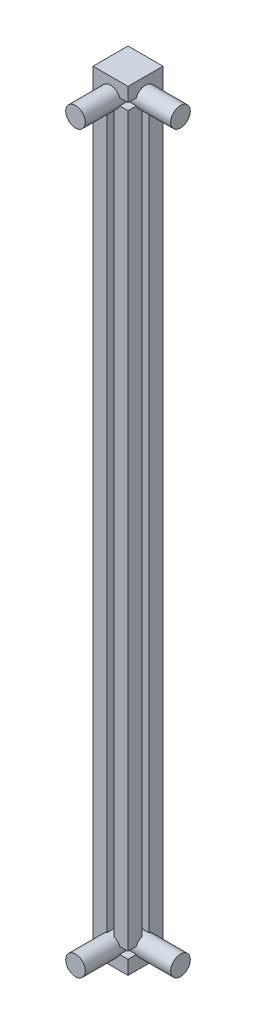
ISO-10303-21;
HEADER;
FILE_DESCRIPTION(('STEP AP214'),'2;1');
FILE_NAME('part.step','',(''),(''),'','','');
FILE_SCHEMA(('AUTOMOTIVE_DESIGN { 1 0 10303 214 1 1 1 1 }'));
ENDSEC;
DATA;
#1=APPLICATION_CONTEXT('core data for automotive mechanical design processes');
#2=APPLICATION_PROTOCOL_DEFINITION('international standard','automotive_design',2000,#1);
#3=PRODUCT_CONTEXT('',#1,'mechanical');
#4=PRODUCT('Part','Part','',(#3));
#5=PRODUCT_RELATED_PRODUCT_CATEGORY('part','',(#4));
#6=PRODUCT_DEFINITION_FORMATION('','',#4);
#7=PRODUCT_DEFINITION_CONTEXT('part definition',#1,'design');
#8=PRODUCT_DEFINITION('design','',#6,#7);
#9=PRODUCT_DEFINITION_SHAPE('','',#8);
#10=(LENGTH_UNIT() NAMED_UNIT(*) SI_UNIT(.MILLI.,.METRE.));
#11=(NAMED_UNIT(*) PLANE_ANGLE_UNIT() SI_UNIT($,.RADIAN.));
#12=(NAMED_UNIT(*) SI_UNIT($,.STERADIAN.) SOLID_ANGLE_UNIT());
#13=UNCERTAINTY_MEASURE_WITH_UNIT(LENGTH_MEASURE(1.E-05),#10,'distance_accuracy_value','');
#14=(GEOMETRIC_REPRESENTATION_CONTEXT(3) GLOBAL_UNCERTAINTY_ASSIGNED_CONTEXT((#13)) GLOBAL_UNIT_ASSIGNED_CONTEXT((#10,
#11,#12)) REPRESENTATION_CONTEXT('',''));
#15=CARTESIAN_POINT('',(0.,0.,0.));
#16=DIRECTION('',(0.,0.,1.));
#17=DIRECTION('',(1.,0.,0.));
#18=AXIS2_PLACEMENT_3D('',#15,#16,#17);
#19=CARTESIAN_POINT('',(10.,-10.,10.));
#20=DIRECTION('',(1.,0.,0.));
#21=DIRECTION('',(0.,0.,-1.));
#22=AXIS2_PLACEMENT_3D('',#19,#20,#21);
#23=PLANE('',#22);
#24=CARTESIAN_POINT('',(10.,-215.,5.));
#25=DIRECTION('',(1.,0.,0.));
#26=DIRECTION('',(0.,0.,-1.));
#27=AXIS2_PLACEMENT_3D('',#24,#25,#26);
#28=CIRCLE('',#27,2.8);
#29=CARTESIAN_POINT('',(10.,-212.384660633876,5.99999999999998));
#30=VERTEX_POINT('',#29);
#31=CARTESIAN_POINT('',(10.,-214.,7.6153393661244));
#32=VERTEX_POINT('',#31);
#33=EDGE_CURVE('E418',#30,#32,#28,.T.);
#34=ORIENTED_EDGE('',*,*,#33,.F.);
#35=DIRECTION('',(0.,-1.,0.));
#36=VECTOR('',#35,1.);
#37=CARTESIAN_POINT('',(10.,-10.,5.99999999999998));
#38=LINE('',#37,#36);
#39=CARTESIAN_POINT('',(10.,-7.61533936612441,5.99999999999998));
#40=VERTEX_POINT('',#39);
#41=EDGE_CURVE('E269',#40,#30,#38,.T.);
#42=ORIENTED_EDGE('',*,*,#41,.F.);
#43=CARTESIAN_POINT('',(10.,-5.,5.));
#44=DIRECTION('',(1.,0.,0.));
#45=DIRECTION('',(0.,0.,-1.));
#46=AXIS2_PLACEMENT_3D('',#43,#44,#45);
#47=CIRCLE('',#46,2.8);
#48=CARTESIAN_POINT('',(10.,-6.,7.61533936612441));
#49=VERTEX_POINT('',#48);
#50=EDGE_CURVE('E64',#49,#40,#47,.T.);
#51=ORIENTED_EDGE('',*,*,#50,.F.);
#52=DIRECTION('',(0.,0.,1.));
#53=VECTOR('',#52,1.);
#54=CARTESIAN_POINT('',(10.,-6.,6.5));
#55=LINE('',#54,#53);
#56=CARTESIAN_POINT('',(10.,-6.00000000000001,10.));
#57=VERTEX_POINT('',#56);
#58=EDGE_CURVE('E247',#49,#57,#55,.T.);
#59=ORIENTED_EDGE('',*,*,#58,.T.);
#60=DIRECTION('',(0.,-1.,0.));
#61=VECTOR('',#60,1.);
#62=CARTESIAN_POINT('',(10.,-10.,10.));
#63=LINE('',#62,#61);
#64=CARTESIAN_POINT('',(10.,-214.,10.));
#65=VERTEX_POINT('',#64);
#66=EDGE_CURVE('E308',#57,#65,#63,.T.);
#67=ORIENTED_EDGE('',*,*,#66,.T.);
#68=DIRECTION('',(0.,0.,1.));
#69=VECTOR('',#68,1.);
#70=CARTESIAN_POINT('',(10.,-214.,6.5));
#71=LINE('',#70,#69);
#72=EDGE_CURVE('E252',#32,#65,#71,.T.);
#73=ORIENTED_EDGE('',*,*,#72,.F.);
#74=EDGE_LOOP('',(#34,#42,#51,#59,#67,#73));
#75=FACE_BOUND('',#74,.T.);
#76=ADVANCED_FACE('F41',(#75),#23,.T.);
#77=CARTESIAN_POINT('',(0.,0.,10.));
#78=DIRECTION('',(0.,0.,1.));
#79=DIRECTION('',(1.,0.,0.));
#80=AXIS2_PLACEMENT_3D('',#77,#78,#79);
#81=PLANE('',#80);
#82=DIRECTION('',(-1.,0.,0.));
#83=VECTOR('',#82,1.);
#84=CARTESIAN_POINT('',(0.,-216.,10.));
#85=LINE('',#84,#83);
#86=CARTESIAN_POINT('',(10.,-216.,10.));
#87=VERTEX_POINT('',#86);
#88=CARTESIAN_POINT('',(7.6153393661244,-216.,10.));
#89=VERTEX_POINT('',#88);
#90=EDGE_CURVE('E294',#87,#89,#85,.T.);
#91=ORIENTED_EDGE('',*,*,#90,.T.);
#92=CARTESIAN_POINT('',(5.,-215.,10.));
#93=DIRECTION('',(0.,0.,1.));
#94=DIRECTION('',(1.,0.,0.));
#95=AXIS2_PLACEMENT_3D('',#92,#93,#94);
#96=CIRCLE('',#95,2.8);
#97=CARTESIAN_POINT('',(4.00000000000002,-212.384660633876,10.));
#98=VERTEX_POINT('',#97);
#99=EDGE_CURVE('E198',#89,#98,#96,.F.);
#100=ORIENTED_EDGE('',*,*,#99,.T.);
#101=DIRECTION('',(0.,-1.,0.));
#102=VECTOR('',#101,1.);
#103=CARTESIAN_POINT('',(4.00000000000003,0.,10.));
#104=LINE('',#103,#102);
#105=CARTESIAN_POINT('',(4.00000000000003,-7.61533936612442,10.));
#106=VERTEX_POINT('',#105);
#107=EDGE_CURVE('E291',#106,#98,#104,.T.);
#108=ORIENTED_EDGE('',*,*,#107,.F.);
#109=CARTESIAN_POINT('',(5.,-5.,10.));
#110=DIRECTION('',(0.,0.,1.));
#111=DIRECTION('',(1.,0.,0.));
#112=AXIS2_PLACEMENT_3D('',#109,#110,#111);
#113=CIRCLE('',#112,2.8);
#114=CARTESIAN_POINT('',(7.61533936612441,-4.,10.));
#115=VERTEX_POINT('',#114);
#116=EDGE_CURVE('E228',#115,#106,#113,.T.);
#117=ORIENTED_EDGE('',*,*,#116,.F.);
#118=DIRECTION('',(-1.,0.,0.));
#119=VECTOR('',#118,1.);
#120=CARTESIAN_POINT('',(0.,-4.,10.));
#121=LINE('',#120,#119);
#122=CARTESIAN_POINT('',(10.,-4.,10.));
#123=VERTEX_POINT('',#122);
#124=EDGE_CURVE('E277',#123,#115,#121,.T.);
#125=ORIENTED_EDGE('',*,*,#124,.F.);
#126=DIRECTION('',(0.,-1.,0.));
#127=VECTOR('',#126,1.);
#128=CARTESIAN_POINT('',(10.,-235.854628860034,10.));
#129=LINE('',#128,#127);
#130=CARTESIAN_POINT('',(10.,0.,10.));
#131=VERTEX_POINT('',#130);
#132=EDGE_CURVE('E243',#131,#123,#129,.T.);
#133=ORIENTED_EDGE('',*,*,#132,.F.);
#134=DIRECTION('',(-1.,0.,0.));
#135=VECTOR('',#134,1.);
#136=CARTESIAN_POINT('',(0.,0.,10.));
#137=LINE('',#136,#135);
#138=CARTESIAN_POINT('',(0.,0.,10.));
#139=VERTEX_POINT('',#138);
#140=EDGE_CURVE('E324',#131,#139,#137,.T.);
#141=ORIENTED_EDGE('',*,*,#140,.T.);
#142=DIRECTION('',(0.,-1.,0.));
#143=VECTOR('',#142,1.);
#144=CARTESIAN_POINT('',(0.,0.,10.));
#145=LINE('',#144,#143);
#146=CARTESIAN_POINT('',(0.,-220.,10.));
#147=VERTEX_POINT('',#146);
#148=EDGE_CURVE('E315',#139,#147,#145,.T.);
#149=ORIENTED_EDGE('',*,*,#148,.T.);
#150=DIRECTION('',(1.,0.,0.));
#151=VECTOR('',#150,1.);
#152=CARTESIAN_POINT('',(0.,-220.,10.));
#153=LINE('',#152,#151);
#154=CARTESIAN_POINT('',(10.,-220.,10.));
#155=VERTEX_POINT('',#154);
#156=EDGE_CURVE('E319',#147,#155,#153,.T.);
#157=ORIENTED_EDGE('',*,*,#156,.T.);
#158=EDGE_CURVE('E240',#87,#155,#129,.T.);
#159=ORIENTED_EDGE('',*,*,#158,.F.);
#160=EDGE_LOOP('',(#91,#100,#108,#117,#125,#133,#141,#149,#157,#159));
#161=FACE_BOUND('',#160,.T.);
#162=ADVANCED_FACE('F366',(#161),#81,.T.);
#163=CARTESIAN_POINT('',(6.00000000000001,0.,6.5));
#164=DIRECTION('',(-1.,0.,0.));
#165=DIRECTION('',(0.,-1.,0.));
#166=AXIS2_PLACEMENT_3D('',#163,#164,#165);
#167=PLANE('',#166);
#168=DIRECTION('',(0.,-1.,0.));
#169=VECTOR('',#168,1.);
#170=CARTESIAN_POINT('',(6.00000000000001,0.,6.5));
#171=LINE('',#170,#169);
#172=CARTESIAN_POINT('',(6.00000000000001,-7.6153393661244,6.5));
#173=VERTEX_POINT('',#172);
#174=CARTESIAN_POINT('',(6.00000000000002,-212.384660633876,6.5));
#175=VERTEX_POINT('',#174);
#176=EDGE_CURVE('E282',#173,#175,#171,.T.);
#177=ORIENTED_EDGE('',*,*,#176,.T.);
#178=DIRECTION('',(0.,0.,1.));
#179=VECTOR('',#178,1.);
#180=CARTESIAN_POINT('',(6.00000000000002,-212.384660633876,0.));
#181=LINE('',#180,#179);
#182=CARTESIAN_POINT('',(6.00000000000002,-212.384660633876,10.));
#183=VERTEX_POINT('',#182);
#184=EDGE_CURVE('E200',#175,#183,#181,.T.);
#185=ORIENTED_EDGE('',*,*,#184,.T.);
#186=DIRECTION('',(0.,-1.,0.));
#187=VECTOR('',#186,1.);
#188=CARTESIAN_POINT('',(6.00000000000001,0.,10.));
#189=LINE('',#188,#187);
#190=CARTESIAN_POINT('',(6.00000000000001,-7.6153393661244,10.));
#191=VERTEX_POINT('',#190);
#192=EDGE_CURVE('E283',#191,#183,#189,.T.);
#193=ORIENTED_EDGE('',*,*,#192,.F.);
#194=DIRECTION('',(0.,0.,1.));
#195=VECTOR('',#194,1.);
#196=CARTESIAN_POINT('',(6.00000000000001,-7.6153393661244,0.));
#197=LINE('',#196,#195);
#198=EDGE_CURVE('E232',#173,#191,#197,.T.);
#199=ORIENTED_EDGE('',*,*,#198,.F.);
#200=EDGE_LOOP('',(#177,#185,#193,#199));
#201=FACE_BOUND('',#200,.T.);
#202=ADVANCED_FACE('F447',(#201),#167,.T.);
#203=CARTESIAN_POINT('',(0.,-214.,6.5));
#204=DIRECTION('',(0.,1.,0.));
#205=DIRECTION('',(0.,0.,1.));
#206=AXIS2_PLACEMENT_3D('',#203,#204,#205);
#207=PLANE('',#206);
#208=DIRECTION('',(0.,0.,1.));
#209=VECTOR('',#208,1.);
#210=CARTESIAN_POINT('',(7.6153393661244,-214.,0.));
#211=LINE('',#210,#209);
#212=CARTESIAN_POINT('',(7.6153393661244,-214.,7.6153393661244));
#213=VERTEX_POINT('',#212);
#214=CARTESIAN_POINT('',(7.6153393661244,-214.,10.));
#215=VERTEX_POINT('',#214);
#216=EDGE_CURVE('E210',#213,#215,#211,.T.);
#217=ORIENTED_EDGE('',*,*,#216,.F.);
#218=DIRECTION('',(1.,0.,0.));
#219=VECTOR('',#218,1.);
#220=CARTESIAN_POINT('',(0.,-214.,7.6153393661244));
#221=LINE('',#220,#219);
#222=EDGE_CURVE('E57',#213,#32,#221,.T.);
#223=ORIENTED_EDGE('',*,*,#222,.T.);
#224=ORIENTED_EDGE('',*,*,#72,.T.);
#225=DIRECTION('',(-1.,0.,0.));
#226=VECTOR('',#225,1.);
#227=CARTESIAN_POINT('',(0.,-214.,10.));
#228=LINE('',#227,#226);
#229=EDGE_CURVE('E301',#65,#215,#228,.T.);
#230=ORIENTED_EDGE('',*,*,#229,.T.);
#231=EDGE_LOOP('',(#217,#223,#224,#230));
#232=FACE_BOUND('',#231,.T.);
#233=ADVANCED_FACE('F483',(#232),#207,.F.);
#234=CARTESIAN_POINT('',(0.,-216.,6.5));
#235=DIRECTION('',(0.,1.,0.));
#236=DIRECTION('',(0.,0.,1.));
#237=AXIS2_PLACEMENT_3D('',#234,#235,#236);
#238=PLANE('',#237);
#239=DIRECTION('',(1.,0.,0.));
#240=VECTOR('',#239,1.);
#241=CARTESIAN_POINT('',(0.,-216.,7.6153393661244));
#242=LINE('',#241,#240);
#243=CARTESIAN_POINT('',(7.6153393661244,-216.,7.6153393661244));
#244=VERTEX_POINT('',#243);
#245=CARTESIAN_POINT('',(10.,-216.,7.6153393661244));
#246=VERTEX_POINT('',#245);
#247=EDGE_CURVE('E179',#244,#246,#242,.T.);
#248=ORIENTED_EDGE('',*,*,#247,.F.);
#249=DIRECTION('',(0.,0.,1.));
#250=VECTOR('',#249,1.);
#251=CARTESIAN_POINT('',(7.6153393661244,-216.,0.));
#252=LINE('',#251,#250);
#253=EDGE_CURVE('E188',#244,#89,#252,.T.);
#254=ORIENTED_EDGE('',*,*,#253,.T.);
#255=ORIENTED_EDGE('',*,*,#90,.F.);
#256=DIRECTION('',(0.,0.,1.));
#257=VECTOR('',#256,1.);
#258=CARTESIAN_POINT('',(10.,-216.,6.5));
#259=LINE('',#258,#257);
#260=EDGE_CURVE('E190',#246,#87,#259,.T.);
#261=ORIENTED_EDGE('',*,*,#260,.F.);
#262=EDGE_LOOP('',(#248,#254,#255,#261));
#263=FACE_BOUND('',#262,.T.);
#264=ADVANCED_FACE('F186',(#263),#238,.T.);
#265=CARTESIAN_POINT('',(4.00000000000003,0.,6.5));
#266=DIRECTION('',(-1.,0.,0.));
#267=DIRECTION('',(0.,-1.,0.));
#268=AXIS2_PLACEMENT_3D('',#265,#266,#267);
#269=PLANE('',#268);
#270=DIRECTION('',(0.,0.,1.));
#271=VECTOR('',#270,1.);
#272=CARTESIAN_POINT('',(4.00000000000002,-212.384660633876,0.));
#273=LINE('',#272,#271);
#274=CARTESIAN_POINT('',(4.00000000000002,-212.384660633876,6.5));
#275=VERTEX_POINT('',#274);
#276=EDGE_CURVE('E378',#275,#98,#273,.T.);
#277=ORIENTED_EDGE('',*,*,#276,.F.);
#278=DIRECTION('',(0.,-1.,0.));
#279=VECTOR('',#278,1.);
#280=CARTESIAN_POINT('',(4.00000000000003,0.,6.5));
#281=LINE('',#280,#279);
#282=CARTESIAN_POINT('',(4.00000000000003,-7.61533936612442,6.5));
#283=VERTEX_POINT('',#282);
#284=EDGE_CURVE('E278',#283,#275,#281,.T.);
#285=ORIENTED_EDGE('',*,*,#284,.F.);
#286=DIRECTION('',(0.,0.,1.));
#287=VECTOR('',#286,1.);
#288=CARTESIAN_POINT('',(4.00000000000003,-7.61533936612442,0.));
#289=LINE('',#288,#287);
#290=EDGE_CURVE('E229',#283,#106,#289,.T.);
#291=ORIENTED_EDGE('',*,*,#290,.T.);
#292=ORIENTED_EDGE('',*,*,#107,.T.);
#293=EDGE_LOOP('',(#277,#285,#291,#292));
#294=FACE_BOUND('',#293,.T.);
#295=ADVANCED_FACE('F620',(#294),#269,.F.);
#296=CARTESIAN_POINT('',(6.5,-213.5,5.99999999999998));
#297=DIRECTION('',(1.,0.,0.));
#298=DIRECTION('',(0.,0.,-1.));
#299=AXIS2_PLACEMENT_3D('',#296,#297,#298);
#300=PLANE('',#299);
#301=CARTESIAN_POINT('',(6.5,-215.,5.));
#302=DIRECTION('',(1.,0.,0.));
#303=DIRECTION('',(0.,0.,-1.));
#304=AXIS2_PLACEMENT_3D('',#301,#302,#303);
#305=CIRCLE('',#304,2.8);
#306=CARTESIAN_POINT('',(6.5,-212.384660633876,3.99999999999998));
#307=VERTEX_POINT('',#306);
#308=CARTESIAN_POINT('',(6.5,-212.384660633876,5.99999999999998));
#309=VERTEX_POINT('',#308);
#310=EDGE_CURVE('E408',#307,#309,#305,.T.);
#311=ORIENTED_EDGE('',*,*,#310,.F.);
#312=DIRECTION('',(0.,1.,0.));
#313=VECTOR('',#312,1.);
#314=CARTESIAN_POINT('',(6.5,-213.5,3.99999999999998));
#315=LINE('',#314,#313);
#316=CARTESIAN_POINT('',(6.5,-7.61533936612441,3.99999999999998));
#317=VERTEX_POINT('',#316);
#318=EDGE_CURVE('E266',#307,#317,#315,.T.);
#319=ORIENTED_EDGE('',*,*,#318,.T.);
#320=CARTESIAN_POINT('',(6.5,-5.,5.));
#321=DIRECTION('',(1.,0.,0.));
#322=DIRECTION('',(0.,0.,-1.));
#323=AXIS2_PLACEMENT_3D('',#320,#321,#322);
#324=CIRCLE('',#323,2.8);
#325=CARTESIAN_POINT('',(6.5,-7.61533936612441,5.99999999999998));
#326=VERTEX_POINT('',#325);
#327=EDGE_CURVE('E384',#326,#317,#324,.T.);
#328=ORIENTED_EDGE('',*,*,#327,.F.);
#329=DIRECTION('',(0.,1.,0.));
#330=VECTOR('',#329,1.);
#331=CARTESIAN_POINT('',(6.5,-213.5,5.99999999999998));
#332=LINE('',#331,#330);
#333=EDGE_CURVE('E263',#309,#326,#332,.T.);
#334=ORIENTED_EDGE('',*,*,#333,.F.);
#335=EDGE_LOOP('',(#311,#319,#328,#334));
#336=FACE_BOUND('',#335,.T.);
#337=ADVANCED_FACE('F475',(#336),#300,.T.);
#338=CARTESIAN_POINT('',(0.,0.,6.5));
#339=DIRECTION('',(0.,0.,1.));
#340=DIRECTION('',(1.,0.,0.));
#341=AXIS2_PLACEMENT_3D('',#338,#339,#340);
#342=PLANE('',#341);
#343=ORIENTED_EDGE('',*,*,#284,.T.);
#344=CARTESIAN_POINT('',(5.,-215.,6.5));
#345=DIRECTION('',(0.,0.,1.));
#346=DIRECTION('',(1.,0.,0.));
#347=AXIS2_PLACEMENT_3D('',#344,#345,#346);
#348=CIRCLE('',#347,2.8);
#349=EDGE_CURVE('E201',#275,#175,#348,.F.);
#350=ORIENTED_EDGE('',*,*,#349,.T.);
#351=ORIENTED_EDGE('',*,*,#176,.F.);
#352=CARTESIAN_POINT('',(5.,-5.,6.5));
#353=DIRECTION('',(0.,0.,1.));
#354=DIRECTION('',(1.,0.,0.));
#355=AXIS2_PLACEMENT_3D('',#352,#353,#354);
#356=CIRCLE('',#355,2.8);
#357=EDGE_CURVE('E236',#283,#173,#356,.T.);
#358=ORIENTED_EDGE('',*,*,#357,.F.);
#359=EDGE_LOOP('',(#343,#350,#351,#358));
#360=FACE_BOUND('',#359,.T.);
#361=ADVANCED_FACE('F489',(#360),#342,.T.);
#362=ORIENTED_EDGE('',*,*,#192,.T.);
#363=EDGE_CURVE('E205',#183,#215,#96,.F.);
#364=ORIENTED_EDGE('',*,*,#363,.T.);
#365=ORIENTED_EDGE('',*,*,#229,.F.);
#366=ORIENTED_EDGE('',*,*,#66,.F.);
#367=DIRECTION('',(-1.,0.,0.));
#368=VECTOR('',#367,1.);
#369=CARTESIAN_POINT('',(0.,-6.,10.));
#370=LINE('',#369,#368);
#371=CARTESIAN_POINT('',(7.61533936612441,-6.,10.));
#372=VERTEX_POINT('',#371);
#373=EDGE_CURVE('E297',#57,#372,#370,.T.);
#374=ORIENTED_EDGE('',*,*,#373,.T.);
#375=EDGE_CURVE('E224',#191,#372,#113,.T.);
#376=ORIENTED_EDGE('',*,*,#375,.F.);
#377=EDGE_LOOP('',(#362,#364,#365,#366,#374,#376));
#378=FACE_BOUND('',#377,.T.);
#379=ADVANCED_FACE('F449',(#378),#81,.T.);
#380=CARTESIAN_POINT('',(0.,0.,0.));
#381=DIRECTION('',(0.,0.,1.));
#382=DIRECTION('',(1.,0.,0.));
#383=AXIS2_PLACEMENT_3D('',#380,#381,#382);
#384=PLANE('',#383);
#385=DIRECTION('',(-1.,0.,0.));
#386=VECTOR('',#385,1.);
#387=CARTESIAN_POINT('',(0.,0.,0.));
#388=LINE('',#387,#386);
#389=CARTESIAN_POINT('',(10.,0.,0.));
#390=VERTEX_POINT('',#389);
#391=CARTESIAN_POINT('',(0.,0.,0.));
#392=VERTEX_POINT('',#391);
#393=EDGE_CURVE('E320',#390,#392,#388,.T.);
#394=ORIENTED_EDGE('',*,*,#393,.F.);
#395=DIRECTION('',(0.,-1.,0.));
#396=VECTOR('',#395,1.);
#397=CARTESIAN_POINT('',(10.,-10.,0.));
#398=LINE('',#397,#396);
#399=CARTESIAN_POINT('',(10.,-220.,0.));
#400=VERTEX_POINT('',#399);
#401=EDGE_CURVE('E287',#390,#400,#398,.T.);
#402=ORIENTED_EDGE('',*,*,#401,.T.);
#403=DIRECTION('',(1.,0.,0.));
#404=VECTOR('',#403,1.);
#405=CARTESIAN_POINT('',(0.,-220.,0.));
#406=LINE('',#405,#404);
#407=CARTESIAN_POINT('',(0.,-220.,0.));
#408=VERTEX_POINT('',#407);
#409=EDGE_CURVE('E331',#408,#400,#406,.T.);
#410=ORIENTED_EDGE('',*,*,#409,.F.);
#411=DIRECTION('',(0.,-1.,0.));
#412=VECTOR('',#411,1.);
#413=CARTESIAN_POINT('',(0.,0.,0.));
#414=LINE('',#413,#412);
#415=EDGE_CURVE('E312',#392,#408,#414,.T.);
#416=ORIENTED_EDGE('',*,*,#415,.F.);
#417=EDGE_LOOP('',(#394,#402,#410,#416));
#418=FACE_BOUND('',#417,.T.);
#419=ADVANCED_FACE('F488',(#418),#384,.F.);
#420=CARTESIAN_POINT('',(0.,0.,10.));
#421=DIRECTION('',(1.,0.,0.));
#422=DIRECTION('',(0.,1.,0.));
#423=AXIS2_PLACEMENT_3D('',#420,#421,#422);
#424=PLANE('',#423);
#425=DIRECTION('',(0.,0.,-1.));
#426=VECTOR('',#425,1.);
#427=CARTESIAN_POINT('',(0.,-220.,10.));
#428=LINE('',#427,#426);
#429=EDGE_CURVE('E340',#147,#408,#428,.T.);
#430=ORIENTED_EDGE('',*,*,#429,.F.);
#431=ORIENTED_EDGE('',*,*,#148,.F.);
#432=DIRECTION('',(0.,0.,-1.));
#433=VECTOR('',#432,1.);
#434=CARTESIAN_POINT('',(0.,0.,10.));
#435=LINE('',#434,#433);
#436=EDGE_CURVE('E327',#139,#392,#435,.T.);
#437=ORIENTED_EDGE('',*,*,#436,.T.);
#438=ORIENTED_EDGE('',*,*,#415,.T.);
#439=EDGE_LOOP('',(#430,#431,#437,#438));
#440=FACE_BOUND('',#439,.T.);
#441=ADVANCED_FACE('F43',(#440),#424,.F.);
#442=CARTESIAN_POINT('',(0.,-220.,10.));
#443=DIRECTION('',(0.,1.,0.));
#444=DIRECTION('',(0.,0.,1.));
#445=AXIS2_PLACEMENT_3D('',#442,#443,#444);
#446=PLANE('',#445);
#447=ORIENTED_EDGE('',*,*,#409,.T.);
#448=DIRECTION('',(0.,0.,1.));
#449=VECTOR('',#448,1.);
#450=CARTESIAN_POINT('',(10.,-220.,10.));
#451=LINE('',#450,#449);
#452=EDGE_CURVE('E259',#400,#155,#451,.T.);
#453=ORIENTED_EDGE('',*,*,#452,.T.);
#454=ORIENTED_EDGE('',*,*,#156,.F.);
#455=ORIENTED_EDGE('',*,*,#429,.T.);
#456=EDGE_LOOP('',(#447,#453,#454,#455));
#457=FACE_BOUND('',#456,.T.);
#458=ADVANCED_FACE('F462',(#457),#446,.F.);
#459=CARTESIAN_POINT('',(0.,0.,10.));
#460=DIRECTION('',(0.,-1.,0.));
#461=DIRECTION('',(0.,0.,-1.));
#462=AXIS2_PLACEMENT_3D('',#459,#460,#461);
#463=PLANE('',#462);
#464=ORIENTED_EDGE('',*,*,#140,.F.);
#465=DIRECTION('',(0.,0.,-1.));
#466=VECTOR('',#465,1.);
#467=CARTESIAN_POINT('',(10.,0.,10.));
#468=LINE('',#467,#466);
#469=EDGE_CURVE('E255',#131,#390,#468,.T.);
#470=ORIENTED_EDGE('',*,*,#469,.T.);
#471=ORIENTED_EDGE('',*,*,#393,.T.);
#472=ORIENTED_EDGE('',*,*,#436,.F.);
#473=EDGE_LOOP('',(#464,#470,#471,#472));
#474=FACE_BOUND('',#473,.T.);
#475=ADVANCED_FACE('F453',(#474),#463,.F.);
#476=CARTESIAN_POINT('',(10.,-212.384660633876,3.99999999999998));
#477=VERTEX_POINT('',#476);
#478=EDGE_CURVE('E419',#246,#477,#28,.T.);
#479=ORIENTED_EDGE('',*,*,#478,.F.);
#480=ORIENTED_EDGE('',*,*,#260,.T.);
#481=ORIENTED_EDGE('',*,*,#158,.T.);
#482=ORIENTED_EDGE('',*,*,#452,.F.);
#483=ORIENTED_EDGE('',*,*,#401,.F.);
#484=ORIENTED_EDGE('',*,*,#469,.F.);
#485=ORIENTED_EDGE('',*,*,#132,.T.);
#486=DIRECTION('',(0.,0.,1.));
#487=VECTOR('',#486,1.);
#488=CARTESIAN_POINT('',(10.,-4.,6.5));
#489=LINE('',#488,#487);
#490=CARTESIAN_POINT('',(10.,-4.,7.6153393661244));
#491=VERTEX_POINT('',#490);
#492=EDGE_CURVE('E244',#491,#123,#489,.T.);
#493=ORIENTED_EDGE('',*,*,#492,.F.);
#494=CARTESIAN_POINT('',(10.,-7.6153393661244,3.99999999999998));
#495=VERTEX_POINT('',#494);
#496=EDGE_CURVE('E397',#495,#491,#47,.T.);
#497=ORIENTED_EDGE('',*,*,#496,.F.);
#498=DIRECTION('',(0.,-1.,0.));
#499=VECTOR('',#498,1.);
#500=CARTESIAN_POINT('',(10.,-10.,3.99999999999998));
#501=LINE('',#500,#499);
#502=EDGE_CURVE('E273',#495,#477,#501,.T.);
#503=ORIENTED_EDGE('',*,*,#502,.T.);
#504=EDGE_LOOP('',(#479,#480,#481,#482,#483,#484,#485,#493,#497,#503));
#505=FACE_BOUND('',#504,.T.);
#506=ADVANCED_FACE('F441',(#505),#23,.T.);
#507=CARTESIAN_POINT('',(0.,-6.,6.5));
#508=DIRECTION('',(0.,1.,0.));
#509=DIRECTION('',(0.,0.,1.));
#510=AXIS2_PLACEMENT_3D('',#507,#508,#509);
#511=PLANE('',#510);
#512=DIRECTION('',(1.,0.,0.));
#513=VECTOR('',#512,1.);
#514=CARTESIAN_POINT('',(0.,-6.,7.61533936612441));
#515=LINE('',#514,#513);
#516=CARTESIAN_POINT('',(7.61533936612441,-6.,7.61533936612441));
#517=VERTEX_POINT('',#516);
#518=EDGE_CURVE('E351',#517,#49,#515,.T.);
#519=ORIENTED_EDGE('',*,*,#518,.F.);
#520=DIRECTION('',(0.,0.,1.));
#521=VECTOR('',#520,1.);
#522=CARTESIAN_POINT('',(7.61533936612441,-6.,0.));
#523=LINE('',#522,#521);
#524=EDGE_CURVE('E221',#372,#517,#523,.F.);
#525=ORIENTED_EDGE('',*,*,#524,.F.);
#526=ORIENTED_EDGE('',*,*,#373,.F.);
#527=ORIENTED_EDGE('',*,*,#58,.F.);
#528=EDGE_LOOP('',(#519,#525,#526,#527));
#529=FACE_BOUND('',#528,.T.);
#530=ADVANCED_FACE('F452',(#529),#511,.T.);
#531=CARTESIAN_POINT('',(0.,-4.,6.5));
#532=DIRECTION('',(0.,1.,0.));
#533=DIRECTION('',(0.,0.,1.));
#534=AXIS2_PLACEMENT_3D('',#531,#532,#533);
#535=PLANE('',#534);
#536=DIRECTION('',(0.,0.,1.));
#537=VECTOR('',#536,1.);
#538=CARTESIAN_POINT('',(7.61533936612441,-4.,0.));
#539=LINE('',#538,#537);
#540=CARTESIAN_POINT('',(7.61533936612441,-4.,7.6153393661244));
#541=VERTEX_POINT('',#540);
#542=EDGE_CURVE('E217',#115,#541,#539,.F.);
#543=ORIENTED_EDGE('',*,*,#542,.T.);
#544=DIRECTION('',(1.,0.,0.));
#545=VECTOR('',#544,1.);
#546=CARTESIAN_POINT('',(0.,-4.,7.6153393661244));
#547=LINE('',#546,#545);
#548=EDGE_CURVE('E353',#541,#491,#547,.T.);
#549=ORIENTED_EDGE('',*,*,#548,.T.);
#550=ORIENTED_EDGE('',*,*,#492,.T.);
#551=ORIENTED_EDGE('',*,*,#124,.T.);
#552=EDGE_LOOP('',(#543,#549,#550,#551));
#553=FACE_BOUND('',#552,.T.);
#554=ADVANCED_FACE('F360',(#553),#535,.F.);
#555=CARTESIAN_POINT('',(6.5,-213.5,3.99999999999998));
#556=DIRECTION('',(0.,0.,1.));
#557=DIRECTION('',(1.,0.,0.));
#558=AXIS2_PLACEMENT_3D('',#555,#556,#557);
#559=PLANE('',#558);
#560=DIRECTION('',(1.,0.,0.));
#561=VECTOR('',#560,1.);
#562=CARTESIAN_POINT('',(0.,-212.384660633876,3.99999999999998));
#563=LINE('',#562,#561);
#564=EDGE_CURVE('E411',#477,#307,#563,.F.);
#565=ORIENTED_EDGE('',*,*,#564,.F.);
#566=ORIENTED_EDGE('',*,*,#502,.F.);
#567=DIRECTION('',(1.,0.,0.));
#568=VECTOR('',#567,1.);
#569=CARTESIAN_POINT('',(0.,-7.6153393661244,3.99999999999998));
#570=LINE('',#569,#568);
#571=EDGE_CURVE('E390',#317,#495,#570,.T.);
#572=ORIENTED_EDGE('',*,*,#571,.F.);
#573=ORIENTED_EDGE('',*,*,#318,.F.);
#574=EDGE_LOOP('',(#565,#566,#572,#573));
#575=FACE_BOUND('',#574,.T.);
#576=ADVANCED_FACE('F471',(#575),#559,.T.);
#577=CARTESIAN_POINT('',(6.5,-213.5,5.99999999999998));
#578=DIRECTION('',(0.,0.,1.));
#579=DIRECTION('',(1.,0.,0.));
#580=AXIS2_PLACEMENT_3D('',#577,#578,#579);
#581=PLANE('',#580);
#582=ORIENTED_EDGE('',*,*,#41,.T.);
#583=DIRECTION('',(1.,0.,0.));
#584=VECTOR('',#583,1.);
#585=CARTESIAN_POINT('',(0.,-212.384660633876,5.99999999999998));
#586=LINE('',#585,#584);
#587=EDGE_CURVE('E414',#30,#309,#586,.F.);
#588=ORIENTED_EDGE('',*,*,#587,.T.);
#589=ORIENTED_EDGE('',*,*,#333,.T.);
#590=DIRECTION('',(1.,0.,0.));
#591=VECTOR('',#590,1.);
#592=CARTESIAN_POINT('',(0.,-7.61533936612441,5.99999999999998));
#593=LINE('',#592,#591);
#594=EDGE_CURVE('E394',#326,#40,#593,.T.);
#595=ORIENTED_EDGE('',*,*,#594,.T.);
#596=EDGE_LOOP('',(#582,#588,#589,#595));
#597=FACE_BOUND('',#596,.T.);
#598=ADVANCED_FACE('F478',(#597),#581,.F.);
#599=CARTESIAN_POINT('',(5.,-5.,0.));
#600=DIRECTION('',(0.,0.,1.));
#601=DIRECTION('',(1.,0.,0.));
#602=AXIS2_PLACEMENT_3D('',#599,#600,#601);
#603=CYLINDRICAL_SURFACE('',#602,2.8);
#604=CARTESIAN_POINT('',(5.,-5.,5.));
#605=DIRECTION('',(-0.707106781186547,0.,0.707106781186547));
#606=DIRECTION('',(0.707106781186547,0.,0.707106781186547));
#607=AXIS2_PLACEMENT_3D('',#604,#605,#606);
#608=ELLIPSE('',#607,3.95979797464467,2.8);
#609=EDGE_CURVE('E50',#541,#517,#608,.F.);
#610=ORIENTED_EDGE('',*,*,#609,.F.);
#611=ORIENTED_EDGE('',*,*,#542,.F.);
#612=ORIENTED_EDGE('',*,*,#116,.T.);
#613=ORIENTED_EDGE('',*,*,#290,.F.);
#614=ORIENTED_EDGE('',*,*,#357,.T.);
#615=ORIENTED_EDGE('',*,*,#198,.T.);
#616=ORIENTED_EDGE('',*,*,#375,.T.);
#617=ORIENTED_EDGE('',*,*,#524,.T.);
#618=EDGE_LOOP('',(#610,#611,#612,#613,#614,#615,#616,#617));
#619=FACE_BOUND('',#618,.T.);
#620=CARTESIAN_POINT('',(5.,-5.,20.));
#621=DIRECTION('',(0.,0.,1.));
#622=DIRECTION('',(1.,0.,0.));
#623=AXIS2_PLACEMENT_3D('',#620,#621,#622);
#624=CIRCLE('',#623,2.8);
#625=CARTESIAN_POINT('',(7.8,-5.,20.));
#626=VERTEX_POINT('',#625);
#627=EDGE_CURVE('E213',#626,#626,#624,.T.);
#628=ORIENTED_EDGE('',*,*,#627,.F.);
#629=EDGE_LOOP('',(#628));
#630=FACE_BOUND('',#629,.T.);
#631=ADVANCED_FACE('F356',(#619,#630),#603,.T.);
#632=CARTESIAN_POINT('',(5.,-5.,20.));
#633=DIRECTION('',(0.,0.,1.));
#634=DIRECTION('',(1.,0.,0.));
#635=AXIS2_PLACEMENT_3D('',#632,#633,#634);
#636=PLANE('',#635);
#637=ORIENTED_EDGE('',*,*,#627,.T.);
#638=EDGE_LOOP('',(#637));
#639=FACE_BOUND('',#638,.T.);
#640=ADVANCED_FACE('F553',(#639),#636,.T.);
#641=CARTESIAN_POINT('',(5.,-215.,0.));
#642=DIRECTION('',(0.,0.,1.));
#643=DIRECTION('',(1.,0.,0.));
#644=AXIS2_PLACEMENT_3D('',#641,#642,#643);
#645=CYLINDRICAL_SURFACE('',#644,2.8);
#646=CARTESIAN_POINT('',(5.,-215.,20.));
#647=DIRECTION('',(0.,0.,-1.));
#648=DIRECTION('',(-1.,0.,0.));
#649=AXIS2_PLACEMENT_3D('',#646,#647,#648);
#650=CIRCLE('',#649,2.8);
#651=CARTESIAN_POINT('',(2.2,-215.,20.));
#652=VERTEX_POINT('',#651);
#653=EDGE_CURVE('E380',#652,#652,#650,.T.);
#654=ORIENTED_EDGE('',*,*,#653,.T.);
#655=EDGE_LOOP('',(#654));
#656=FACE_BOUND('',#655,.T.);
#657=ORIENTED_EDGE('',*,*,#253,.F.);
#658=CARTESIAN_POINT('',(5.,-215.,5.));
#659=DIRECTION('',(-0.707106781186547,0.,0.707106781186547));
#660=DIRECTION('',(0.707106781186547,0.,0.707106781186547));
#661=AXIS2_PLACEMENT_3D('',#658,#659,#660);
#662=ELLIPSE('',#661,3.95979797464466,2.8);
#663=EDGE_CURVE('E11',#244,#213,#662,.T.);
#664=ORIENTED_EDGE('',*,*,#663,.T.);
#665=ORIENTED_EDGE('',*,*,#216,.T.);
#666=ORIENTED_EDGE('',*,*,#363,.F.);
#667=ORIENTED_EDGE('',*,*,#184,.F.);
#668=ORIENTED_EDGE('',*,*,#349,.F.);
#669=ORIENTED_EDGE('',*,*,#276,.T.);
#670=ORIENTED_EDGE('',*,*,#99,.F.);
#671=EDGE_LOOP('',(#657,#664,#665,#666,#667,#668,#669,#670));
#672=FACE_BOUND('',#671,.T.);
#673=ADVANCED_FACE('F195',(#656,#672),#645,.T.);
#674=CARTESIAN_POINT('',(5.,-215.,20.));
#675=DIRECTION('',(0.,0.,-1.));
#676=DIRECTION('',(-1.,0.,0.));
#677=AXIS2_PLACEMENT_3D('',#674,#675,#676);
#678=PLANE('',#677);
#679=ORIENTED_EDGE('',*,*,#653,.F.);
#680=EDGE_LOOP('',(#679));
#681=FACE_BOUND('',#680,.T.);
#682=ADVANCED_FACE('F565',(#681),#678,.F.);
#683=CARTESIAN_POINT('',(0.,-5.,5.));
#684=DIRECTION('',(1.,0.,0.));
#685=DIRECTION('',(0.,0.,-1.));
#686=AXIS2_PLACEMENT_3D('',#683,#684,#685);
#687=CYLINDRICAL_SURFACE('',#686,2.8);
#688=ORIENTED_EDGE('',*,*,#594,.F.);
#689=ORIENTED_EDGE('',*,*,#327,.T.);
#690=ORIENTED_EDGE('',*,*,#571,.T.);
#691=ORIENTED_EDGE('',*,*,#496,.T.);
#692=ORIENTED_EDGE('',*,*,#548,.F.);
#693=ORIENTED_EDGE('',*,*,#609,.T.);
#694=ORIENTED_EDGE('',*,*,#518,.T.);
#695=ORIENTED_EDGE('',*,*,#50,.T.);
#696=EDGE_LOOP('',(#688,#689,#690,#691,#692,#693,#694,#695));
#697=FACE_BOUND('',#696,.T.);
#698=CARTESIAN_POINT('',(20.,-5.,5.));
#699=DIRECTION('',(1.,0.,0.));
#700=DIRECTION('',(0.,0.,-1.));
#701=AXIS2_PLACEMENT_3D('',#698,#699,#700);
#702=CIRCLE('',#701,2.8);
#703=CARTESIAN_POINT('',(20.,-5.,2.2));
#704=VERTEX_POINT('',#703);
#705=EDGE_CURVE('E404',#704,#704,#702,.T.);
#706=ORIENTED_EDGE('',*,*,#705,.F.);
#707=EDGE_LOOP('',(#706));
#708=FACE_BOUND('',#707,.T.);
#709=ADVANCED_FACE('F348',(#697,#708),#687,.T.);
#710=CARTESIAN_POINT('',(20.,-5.,5.));
#711=DIRECTION('',(1.,0.,0.));
#712=DIRECTION('',(0.,0.,-1.));
#713=AXIS2_PLACEMENT_3D('',#710,#711,#712);
#714=PLANE('',#713);
#715=ORIENTED_EDGE('',*,*,#705,.T.);
#716=EDGE_LOOP('',(#715));
#717=FACE_BOUND('',#716,.T.);
#718=ADVANCED_FACE('F430',(#717),#714,.T.);
#719=CARTESIAN_POINT('',(0.,-215.,5.));
#720=DIRECTION('',(1.,0.,0.));
#721=DIRECTION('',(0.,0.,-1.));
#722=AXIS2_PLACEMENT_3D('',#719,#720,#721);
#723=CYLINDRICAL_SURFACE('',#722,2.8);
#724=ORIENTED_EDGE('',*,*,#564,.T.);
#725=ORIENTED_EDGE('',*,*,#310,.T.);
#726=ORIENTED_EDGE('',*,*,#587,.F.);
#727=ORIENTED_EDGE('',*,*,#33,.T.);
#728=ORIENTED_EDGE('',*,*,#222,.F.);
#729=ORIENTED_EDGE('',*,*,#663,.F.);
#730=ORIENTED_EDGE('',*,*,#247,.T.);
#731=ORIENTED_EDGE('',*,*,#478,.T.);
#732=EDGE_LOOP('',(#724,#725,#726,#727,#728,#729,#730,#731));
#733=FACE_BOUND('',#732,.T.);
#734=CARTESIAN_POINT('',(20.,-215.,5.));
#735=DIRECTION('',(1.,0.,0.));
#736=DIRECTION('',(0.,0.,1.));
#737=AXIS2_PLACEMENT_3D('',#734,#735,#736);
#738=CIRCLE('',#737,2.8);
#739=CARTESIAN_POINT('',(20.,-215.,7.8));
#740=VERTEX_POINT('',#739);
#741=EDGE_CURVE('E192',#740,#740,#738,.T.);
#742=ORIENTED_EDGE('',*,*,#741,.F.);
#743=EDGE_LOOP('',(#742));
#744=FACE_BOUND('',#743,.T.);
#745=ADVANCED_FACE('F177',(#733,#744),#723,.T.);
#746=CARTESIAN_POINT('',(20.,-215.,5.));
#747=DIRECTION('',(-1.,0.,0.));
#748=DIRECTION('',(0.,0.,1.));
#749=AXIS2_PLACEMENT_3D('',#746,#747,#748);
#750=PLANE('',#749);
#751=ORIENTED_EDGE('',*,*,#741,.T.);
#752=EDGE_LOOP('',(#751));
#753=FACE_BOUND('',#752,.T.);
#754=ADVANCED_FACE('F428',(#753),#750,.F.);
#755=CLOSED_SHELL('',(#76,#162,#202,#233,#264,#295,#337,#361,#379,#419,#441,#458,#475,#506,#530,
#554,#576,#598,#631,#640,#673,#682,#709,#718,#745,#754));
#756=MANIFOLD_SOLID_BREP('B2',#755);
#757=ADVANCED_BREP_SHAPE_REPRESENTATION('',(#18,#756),#14);
#758=SHAPE_DEFINITION_REPRESENTATION(#9,#757);
ENDSEC;
END-ISO-10303-21;
